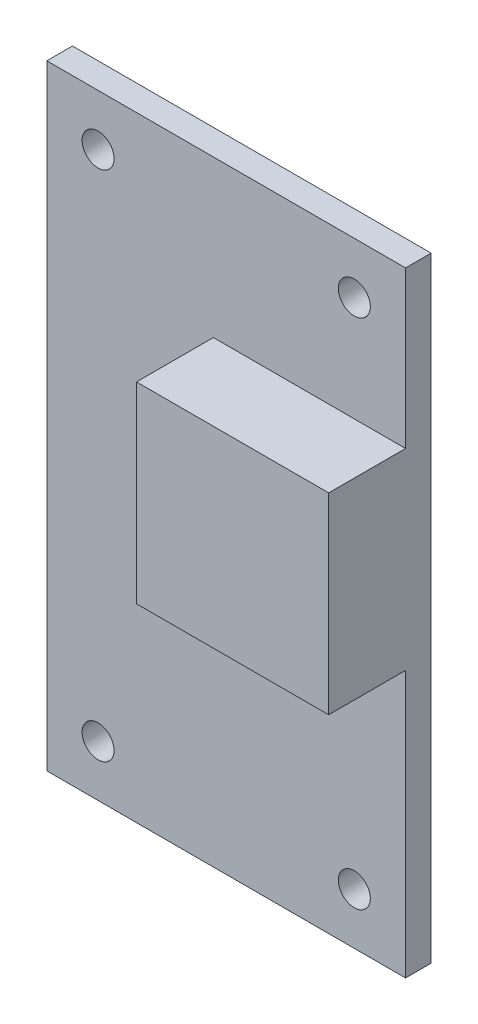
ISO-10303-21;
HEADER;
FILE_DESCRIPTION(('STEP AP214'),'2;1');
FILE_NAME('part.step','',(''),(''),'','','');
FILE_SCHEMA(('AUTOMOTIVE_DESIGN { 1 0 10303 214 1 1 1 1 }'));
ENDSEC;
DATA;
#1=APPLICATION_CONTEXT('core data for automotive mechanical design processes');
#2=APPLICATION_PROTOCOL_DEFINITION('international standard','automotive_design',2000,#1);
#3=PRODUCT_CONTEXT('',#1,'mechanical');
#4=PRODUCT('Part','Part','',(#3));
#5=PRODUCT_RELATED_PRODUCT_CATEGORY('part','',(#4));
#6=PRODUCT_DEFINITION_FORMATION('','',#4);
#7=PRODUCT_DEFINITION_CONTEXT('part definition',#1,'design');
#8=PRODUCT_DEFINITION('design','',#6,#7);
#9=PRODUCT_DEFINITION_SHAPE('','',#8);
#10=(LENGTH_UNIT() NAMED_UNIT(*) SI_UNIT(.MILLI.,.METRE.));
#11=(NAMED_UNIT(*) PLANE_ANGLE_UNIT() SI_UNIT($,.RADIAN.));
#12=(NAMED_UNIT(*) SI_UNIT($,.STERADIAN.) SOLID_ANGLE_UNIT());
#13=UNCERTAINTY_MEASURE_WITH_UNIT(LENGTH_MEASURE(1.E-05),#10,'distance_accuracy_value','');
#14=(GEOMETRIC_REPRESENTATION_CONTEXT(3) GLOBAL_UNCERTAINTY_ASSIGNED_CONTEXT((#13)) GLOBAL_UNIT_ASSIGNED_CONTEXT((#10,
#11,#12)) REPRESENTATION_CONTEXT('',''));
#15=CARTESIAN_POINT('',(0.,0.,0.));
#16=DIRECTION('',(0.,0.,1.));
#17=DIRECTION('',(1.,0.,0.));
#18=AXIS2_PLACEMENT_3D('',#15,#16,#17);
#19=CARTESIAN_POINT('',(0.,0.,2.));
#20=DIRECTION('',(0.,0.,-1.));
#21=DIRECTION('',(-1.,0.,0.));
#22=AXIS2_PLACEMENT_3D('',#19,#20,#21);
#23=PLANE('',#22);
#24=CARTESIAN_POINT('',(-10.,20.,2.));
#25=DIRECTION('',(0.,0.,1.));
#26=DIRECTION('',(1.,0.,0.));
#27=AXIS2_PLACEMENT_3D('',#24,#25,#26);
#28=CIRCLE('',#27,1.25);
#29=CARTESIAN_POINT('',(-8.75,20.,2.));
#30=VERTEX_POINT('',#29);
#31=EDGE_CURVE('E134',#30,#30,#28,.T.);
#32=ORIENTED_EDGE('',*,*,#31,.F.);
#33=EDGE_LOOP('',(#32));
#34=FACE_BOUND('',#33,.T.);
#35=CARTESIAN_POINT('',(10.,20.,2.));
#36=DIRECTION('',(0.,0.,1.));
#37=DIRECTION('',(1.,0.,0.));
#38=AXIS2_PLACEMENT_3D('',#35,#36,#37);
#39=CIRCLE('',#38,1.25);
#40=CARTESIAN_POINT('',(11.25,20.,2.));
#41=VERTEX_POINT('',#40);
#42=EDGE_CURVE('E135',#41,#41,#39,.T.);
#43=ORIENTED_EDGE('',*,*,#42,.F.);
#44=EDGE_LOOP('',(#43));
#45=FACE_BOUND('',#44,.T.);
#46=CARTESIAN_POINT('',(10.,-20.,2.));
#47=DIRECTION('',(0.,0.,1.));
#48=DIRECTION('',(1.,0.,0.));
#49=AXIS2_PLACEMENT_3D('',#46,#47,#48);
#50=CIRCLE('',#49,1.25);
#51=CARTESIAN_POINT('',(11.25,-20.,2.));
#52=VERTEX_POINT('',#51);
#53=EDGE_CURVE('E141',#52,#52,#50,.T.);
#54=ORIENTED_EDGE('',*,*,#53,.F.);
#55=EDGE_LOOP('',(#54));
#56=FACE_BOUND('',#55,.T.);
#57=CARTESIAN_POINT('',(-10.,-20.,2.));
#58=DIRECTION('',(0.,0.,1.));
#59=DIRECTION('',(1.,0.,0.));
#60=AXIS2_PLACEMENT_3D('',#57,#58,#59);
#61=CIRCLE('',#60,1.25);
#62=CARTESIAN_POINT('',(-8.75,-20.,2.));
#63=VERTEX_POINT('',#62);
#64=EDGE_CURVE('E122',#63,#63,#61,.T.);
#65=ORIENTED_EDGE('',*,*,#64,.F.);
#66=EDGE_LOOP('',(#65));
#67=FACE_BOUND('',#66,.T.);
#68=DIRECTION('',(1.,0.,0.));
#69=VECTOR('',#68,1.);
#70=CARTESIAN_POINT('',(14.,-3.20687743196867,2.));
#71=LINE('',#70,#69);
#72=CARTESIAN_POINT('',(-0.999999999999999,-3.20687743196867,2.));
#73=VERTEX_POINT('',#72);
#74=CARTESIAN_POINT('',(14.,-3.20687743196867,2.));
#75=VERTEX_POINT('',#74);
#76=EDGE_CURVE('E50',#73,#75,#71,.T.);
#77=ORIENTED_EDGE('',*,*,#76,.F.);
#78=DIRECTION('',(0.,-1.,0.));
#79=VECTOR('',#78,1.);
#80=CARTESIAN_POINT('',(-0.999999999999999,11.7931225680313,2.));
#81=LINE('',#80,#79);
#82=CARTESIAN_POINT('',(-0.999999999999999,11.7931225680313,2.));
#83=VERTEX_POINT('',#82);
#84=EDGE_CURVE('E195',#83,#73,#81,.T.);
#85=ORIENTED_EDGE('',*,*,#84,.F.);
#86=DIRECTION('',(-1.,0.,0.));
#87=VECTOR('',#86,1.);
#88=CARTESIAN_POINT('',(14.,11.7931225680313,2.));
#89=LINE('',#88,#87);
#90=CARTESIAN_POINT('',(14.,11.7931225680313,2.));
#91=VERTEX_POINT('',#90);
#92=EDGE_CURVE('E56',#91,#83,#89,.T.);
#93=ORIENTED_EDGE('',*,*,#92,.F.);
#94=DIRECTION('',(0.,1.,0.));
#95=VECTOR('',#94,1.);
#96=CARTESIAN_POINT('',(14.,-24.,2.));
#97=LINE('',#96,#95);
#98=CARTESIAN_POINT('',(14.,24.,2.));
#99=VERTEX_POINT('',#98);
#100=EDGE_CURVE('E121',#91,#99,#97,.T.);
#101=ORIENTED_EDGE('',*,*,#100,.T.);
#102=DIRECTION('',(-1.,0.,0.));
#103=VECTOR('',#102,1.);
#104=CARTESIAN_POINT('',(-14.,24.,2.));
#105=LINE('',#104,#103);
#106=CARTESIAN_POINT('',(-14.,24.,2.));
#107=VERTEX_POINT('',#106);
#108=EDGE_CURVE('E154',#99,#107,#105,.T.);
#109=ORIENTED_EDGE('',*,*,#108,.T.);
#110=DIRECTION('',(0.,-1.,0.));
#111=VECTOR('',#110,1.);
#112=CARTESIAN_POINT('',(-14.,-24.,2.));
#113=LINE('',#112,#111);
#114=CARTESIAN_POINT('',(-14.,-24.,2.));
#115=VERTEX_POINT('',#114);
#116=EDGE_CURVE('E156',#107,#115,#113,.T.);
#117=ORIENTED_EDGE('',*,*,#116,.T.);
#118=DIRECTION('',(1.,0.,0.));
#119=VECTOR('',#118,1.);
#120=CARTESIAN_POINT('',(-14.,-24.,2.));
#121=LINE('',#120,#119);
#122=CARTESIAN_POINT('',(14.,-24.,2.));
#123=VERTEX_POINT('',#122);
#124=EDGE_CURVE('E158',#115,#123,#121,.T.);
#125=ORIENTED_EDGE('',*,*,#124,.T.);
#126=EDGE_CURVE('E152',#123,#75,#97,.T.);
#127=ORIENTED_EDGE('',*,*,#126,.T.);
#128=EDGE_LOOP('',(#77,#85,#93,#101,#109,#117,#125,#127));
#129=FACE_BOUND('',#128,.T.);
#130=ADVANCED_FACE('F35',(#34,#45,#56,#67,#129),#23,.F.);
#131=CARTESIAN_POINT('',(14.,-24.,2.));
#132=DIRECTION('',(-1.,0.,0.));
#133=DIRECTION('',(0.,0.,1.));
#134=AXIS2_PLACEMENT_3D('',#131,#132,#133);
#135=PLANE('',#134);
#136=DIRECTION('',(0.,1.,0.));
#137=VECTOR('',#136,1.);
#138=CARTESIAN_POINT('',(14.,-24.,0.));
#139=LINE('',#138,#137);
#140=CARTESIAN_POINT('',(14.,-24.,0.));
#141=VERTEX_POINT('',#140);
#142=CARTESIAN_POINT('',(14.,24.,0.));
#143=VERTEX_POINT('',#142);
#144=EDGE_CURVE('E149',#141,#143,#139,.T.);
#145=ORIENTED_EDGE('',*,*,#144,.T.);
#146=DIRECTION('',(0.,0.,-1.));
#147=VECTOR('',#146,1.);
#148=CARTESIAN_POINT('',(14.,24.,2.));
#149=LINE('',#148,#147);
#150=EDGE_CURVE('E11',#99,#143,#149,.T.);
#151=ORIENTED_EDGE('',*,*,#150,.F.);
#152=ORIENTED_EDGE('',*,*,#100,.F.);
#153=DIRECTION('',(0.,0.,-1.));
#154=VECTOR('',#153,1.);
#155=CARTESIAN_POINT('',(14.,11.7931225680313,8.));
#156=LINE('',#155,#154);
#157=CARTESIAN_POINT('',(14.,11.7931225680313,8.));
#158=VERTEX_POINT('',#157);
#159=EDGE_CURVE('E103',#158,#91,#156,.T.);
#160=ORIENTED_EDGE('',*,*,#159,.F.);
#161=DIRECTION('',(0.,1.,0.));
#162=VECTOR('',#161,1.);
#163=CARTESIAN_POINT('',(14.,11.7931225680313,8.));
#164=LINE('',#163,#162);
#165=CARTESIAN_POINT('',(14.,-3.20687743196867,8.));
#166=VERTEX_POINT('',#165);
#167=EDGE_CURVE('E109',#166,#158,#164,.T.);
#168=ORIENTED_EDGE('',*,*,#167,.F.);
#169=DIRECTION('',(0.,0.,-1.));
#170=VECTOR('',#169,1.);
#171=CARTESIAN_POINT('',(14.,-3.20687743196867,8.));
#172=LINE('',#171,#170);
#173=EDGE_CURVE('E190',#166,#75,#172,.T.);
#174=ORIENTED_EDGE('',*,*,#173,.T.);
#175=ORIENTED_EDGE('',*,*,#126,.F.);
#176=DIRECTION('',(0.,0.,-1.));
#177=VECTOR('',#176,1.);
#178=CARTESIAN_POINT('',(14.,-24.,2.));
#179=LINE('',#178,#177);
#180=EDGE_CURVE('E160',#123,#141,#179,.T.);
#181=ORIENTED_EDGE('',*,*,#180,.T.);
#182=EDGE_LOOP('',(#145,#151,#152,#160,#168,#174,#175,#181));
#183=FACE_BOUND('',#182,.T.);
#184=ADVANCED_FACE('F37',(#183),#135,.F.);
#185=CARTESIAN_POINT('',(-14.,24.,2.));
#186=DIRECTION('',(0.,-1.,0.));
#187=DIRECTION('',(0.,0.,-1.));
#188=AXIS2_PLACEMENT_3D('',#185,#186,#187);
#189=PLANE('',#188);
#190=DIRECTION('',(-1.,0.,0.));
#191=VECTOR('',#190,1.);
#192=CARTESIAN_POINT('',(-14.,24.,0.));
#193=LINE('',#192,#191);
#194=CARTESIAN_POINT('',(-14.,24.,0.));
#195=VERTEX_POINT('',#194);
#196=EDGE_CURVE('E162',#143,#195,#193,.T.);
#197=ORIENTED_EDGE('',*,*,#196,.T.);
#198=DIRECTION('',(0.,0.,-1.));
#199=VECTOR('',#198,1.);
#200=CARTESIAN_POINT('',(-14.,24.,2.));
#201=LINE('',#200,#199);
#202=EDGE_CURVE('E43',#107,#195,#201,.T.);
#203=ORIENTED_EDGE('',*,*,#202,.F.);
#204=ORIENTED_EDGE('',*,*,#108,.F.);
#205=ORIENTED_EDGE('',*,*,#150,.T.);
#206=EDGE_LOOP('',(#197,#203,#204,#205));
#207=FACE_BOUND('',#206,.T.);
#208=ADVANCED_FACE('F221',(#207),#189,.F.);
#209=CARTESIAN_POINT('',(-14.,-24.,2.));
#210=DIRECTION('',(1.,0.,0.));
#211=DIRECTION('',(0.,0.,-1.));
#212=AXIS2_PLACEMENT_3D('',#209,#210,#211);
#213=PLANE('',#212);
#214=DIRECTION('',(0.,-1.,0.));
#215=VECTOR('',#214,1.);
#216=CARTESIAN_POINT('',(-14.,-24.,0.));
#217=LINE('',#216,#215);
#218=CARTESIAN_POINT('',(-14.,-24.,0.));
#219=VERTEX_POINT('',#218);
#220=EDGE_CURVE('E164',#195,#219,#217,.T.);
#221=ORIENTED_EDGE('',*,*,#220,.T.);
#222=DIRECTION('',(0.,0.,-1.));
#223=VECTOR('',#222,1.);
#224=CARTESIAN_POINT('',(-14.,-24.,2.));
#225=LINE('',#224,#223);
#226=EDGE_CURVE('E170',#115,#219,#225,.T.);
#227=ORIENTED_EDGE('',*,*,#226,.F.);
#228=ORIENTED_EDGE('',*,*,#116,.F.);
#229=ORIENTED_EDGE('',*,*,#202,.T.);
#230=EDGE_LOOP('',(#221,#227,#228,#229));
#231=FACE_BOUND('',#230,.T.);
#232=ADVANCED_FACE('F177',(#231),#213,.F.);
#233=CARTESIAN_POINT('',(-14.,-24.,2.));
#234=DIRECTION('',(0.,1.,0.));
#235=DIRECTION('',(0.,0.,1.));
#236=AXIS2_PLACEMENT_3D('',#233,#234,#235);
#237=PLANE('',#236);
#238=DIRECTION('',(1.,0.,0.));
#239=VECTOR('',#238,1.);
#240=CARTESIAN_POINT('',(-14.,-24.,0.));
#241=LINE('',#240,#239);
#242=EDGE_CURVE('E166',#219,#141,#241,.T.);
#243=ORIENTED_EDGE('',*,*,#242,.T.);
#244=ORIENTED_EDGE('',*,*,#180,.F.);
#245=ORIENTED_EDGE('',*,*,#124,.F.);
#246=ORIENTED_EDGE('',*,*,#226,.T.);
#247=EDGE_LOOP('',(#243,#244,#245,#246));
#248=FACE_BOUND('',#247,.T.);
#249=ADVANCED_FACE('F187',(#248),#237,.F.);
#250=CARTESIAN_POINT('',(0.,0.,0.));
#251=DIRECTION('',(0.,0.,-1.));
#252=DIRECTION('',(-1.,0.,0.));
#253=AXIS2_PLACEMENT_3D('',#250,#251,#252);
#254=PLANE('',#253);
#255=CARTESIAN_POINT('',(-10.,-20.,0.));
#256=DIRECTION('',(0.,0.,1.));
#257=DIRECTION('',(1.,0.,0.));
#258=AXIS2_PLACEMENT_3D('',#255,#256,#257);
#259=CIRCLE('',#258,1.25);
#260=CARTESIAN_POINT('',(-8.75,-20.,0.));
#261=VERTEX_POINT('',#260);
#262=EDGE_CURVE('E125',#261,#261,#259,.T.);
#263=ORIENTED_EDGE('',*,*,#262,.T.);
#264=EDGE_LOOP('',(#263));
#265=FACE_BOUND('',#264,.T.);
#266=CARTESIAN_POINT('',(10.,-20.,0.));
#267=DIRECTION('',(0.,0.,1.));
#268=DIRECTION('',(1.,0.,0.));
#269=AXIS2_PLACEMENT_3D('',#266,#267,#268);
#270=CIRCLE('',#269,1.25);
#271=CARTESIAN_POINT('',(11.25,-20.,0.));
#272=VERTEX_POINT('',#271);
#273=EDGE_CURVE('E138',#272,#272,#270,.T.);
#274=ORIENTED_EDGE('',*,*,#273,.T.);
#275=EDGE_LOOP('',(#274));
#276=FACE_BOUND('',#275,.T.);
#277=CARTESIAN_POINT('',(10.,20.,0.));
#278=DIRECTION('',(0.,0.,1.));
#279=DIRECTION('',(1.,0.,0.));
#280=AXIS2_PLACEMENT_3D('',#277,#278,#279);
#281=CIRCLE('',#280,1.25);
#282=CARTESIAN_POINT('',(11.25,20.,0.));
#283=VERTEX_POINT('',#282);
#284=EDGE_CURVE('E131',#283,#283,#281,.T.);
#285=ORIENTED_EDGE('',*,*,#284,.T.);
#286=EDGE_LOOP('',(#285));
#287=FACE_BOUND('',#286,.T.);
#288=CARTESIAN_POINT('',(-10.,20.,0.));
#289=DIRECTION('',(0.,0.,1.));
#290=DIRECTION('',(1.,0.,0.));
#291=AXIS2_PLACEMENT_3D('',#288,#289,#290);
#292=CIRCLE('',#291,1.25);
#293=CARTESIAN_POINT('',(-8.75,20.,0.));
#294=VERTEX_POINT('',#293);
#295=EDGE_CURVE('E146',#294,#294,#292,.T.);
#296=ORIENTED_EDGE('',*,*,#295,.T.);
#297=EDGE_LOOP('',(#296));
#298=FACE_BOUND('',#297,.T.);
#299=ORIENTED_EDGE('',*,*,#144,.F.);
#300=ORIENTED_EDGE('',*,*,#242,.F.);
#301=ORIENTED_EDGE('',*,*,#220,.F.);
#302=ORIENTED_EDGE('',*,*,#196,.F.);
#303=EDGE_LOOP('',(#299,#300,#301,#302));
#304=FACE_BOUND('',#303,.T.);
#305=ADVANCED_FACE('F184',(#265,#276,#287,#298,#304),#254,.T.);
#306=CARTESIAN_POINT('',(-10.,20.,0.));
#307=DIRECTION('',(0.,0.,1.));
#308=DIRECTION('',(1.,0.,0.));
#309=AXIS2_PLACEMENT_3D('',#306,#307,#308);
#310=CYLINDRICAL_SURFACE('',#309,1.25);
#311=ORIENTED_EDGE('',*,*,#295,.F.);
#312=EDGE_LOOP('',(#311));
#313=FACE_BOUND('',#312,.T.);
#314=ORIENTED_EDGE('',*,*,#31,.T.);
#315=EDGE_LOOP('',(#314));
#316=FACE_BOUND('',#315,.T.);
#317=ADVANCED_FACE('F226',(#313,#316),#310,.F.);
#318=CARTESIAN_POINT('',(10.,20.,0.));
#319=DIRECTION('',(0.,0.,1.));
#320=DIRECTION('',(1.,0.,0.));
#321=AXIS2_PLACEMENT_3D('',#318,#319,#320);
#322=CYLINDRICAL_SURFACE('',#321,1.25);
#323=ORIENTED_EDGE('',*,*,#284,.F.);
#324=EDGE_LOOP('',(#323));
#325=FACE_BOUND('',#324,.T.);
#326=ORIENTED_EDGE('',*,*,#42,.T.);
#327=EDGE_LOOP('',(#326));
#328=FACE_BOUND('',#327,.T.);
#329=ADVANCED_FACE('F255',(#325,#328),#322,.F.);
#330=CARTESIAN_POINT('',(10.,-20.,0.));
#331=DIRECTION('',(0.,0.,1.));
#332=DIRECTION('',(1.,0.,0.));
#333=AXIS2_PLACEMENT_3D('',#330,#331,#332);
#334=CYLINDRICAL_SURFACE('',#333,1.25);
#335=ORIENTED_EDGE('',*,*,#273,.F.);
#336=EDGE_LOOP('',(#335));
#337=FACE_BOUND('',#336,.T.);
#338=ORIENTED_EDGE('',*,*,#53,.T.);
#339=EDGE_LOOP('',(#338));
#340=FACE_BOUND('',#339,.T.);
#341=ADVANCED_FACE('F262',(#337,#340),#334,.F.);
#342=CARTESIAN_POINT('',(-10.,-20.,0.));
#343=DIRECTION('',(0.,0.,1.));
#344=DIRECTION('',(1.,0.,0.));
#345=AXIS2_PLACEMENT_3D('',#342,#343,#344);
#346=CYLINDRICAL_SURFACE('',#345,1.25);
#347=ORIENTED_EDGE('',*,*,#262,.F.);
#348=EDGE_LOOP('',(#347));
#349=FACE_BOUND('',#348,.T.);
#350=ORIENTED_EDGE('',*,*,#64,.T.);
#351=EDGE_LOOP('',(#350));
#352=FACE_BOUND('',#351,.T.);
#353=ADVANCED_FACE('F211',(#349,#352),#346,.F.);
#354=CARTESIAN_POINT('',(14.,11.7931225680313,8.));
#355=DIRECTION('',(0.,-1.,0.));
#356=DIRECTION('',(0.,0.,-1.));
#357=AXIS2_PLACEMENT_3D('',#354,#355,#356);
#358=PLANE('',#357);
#359=ORIENTED_EDGE('',*,*,#92,.T.);
#360=DIRECTION('',(0.,0.,-1.));
#361=VECTOR('',#360,1.);
#362=CARTESIAN_POINT('',(-0.999999999999999,11.7931225680313,8.));
#363=LINE('',#362,#361);
#364=CARTESIAN_POINT('',(-0.999999999999999,11.7931225680313,8.));
#365=VERTEX_POINT('',#364);
#366=EDGE_CURVE('E105',#365,#83,#363,.T.);
#367=ORIENTED_EDGE('',*,*,#366,.F.);
#368=DIRECTION('',(-1.,0.,0.));
#369=VECTOR('',#368,1.);
#370=CARTESIAN_POINT('',(14.,11.7931225680313,8.));
#371=LINE('',#370,#369);
#372=EDGE_CURVE('E99',#158,#365,#371,.T.);
#373=ORIENTED_EDGE('',*,*,#372,.F.);
#374=ORIENTED_EDGE('',*,*,#159,.T.);
#375=EDGE_LOOP('',(#359,#367,#373,#374));
#376=FACE_BOUND('',#375,.T.);
#377=ADVANCED_FACE('F101',(#376),#358,.F.);
#378=CARTESIAN_POINT('',(-0.999999999999999,11.7931225680313,8.));
#379=DIRECTION('',(1.,0.,0.));
#380=DIRECTION('',(0.,0.,-1.));
#381=AXIS2_PLACEMENT_3D('',#378,#379,#380);
#382=PLANE('',#381);
#383=ORIENTED_EDGE('',*,*,#84,.T.);
#384=DIRECTION('',(0.,0.,-1.));
#385=VECTOR('',#384,1.);
#386=CARTESIAN_POINT('',(-0.999999999999999,-3.20687743196867,8.));
#387=LINE('',#386,#385);
#388=CARTESIAN_POINT('',(-0.999999999999999,-3.20687743196867,8.));
#389=VERTEX_POINT('',#388);
#390=EDGE_CURVE('E127',#389,#73,#387,.T.);
#391=ORIENTED_EDGE('',*,*,#390,.F.);
#392=DIRECTION('',(0.,-1.,0.));
#393=VECTOR('',#392,1.);
#394=CARTESIAN_POINT('',(-0.999999999999999,11.7931225680313,8.));
#395=LINE('',#394,#393);
#396=EDGE_CURVE('E108',#365,#389,#395,.T.);
#397=ORIENTED_EDGE('',*,*,#396,.F.);
#398=ORIENTED_EDGE('',*,*,#366,.T.);
#399=EDGE_LOOP('',(#383,#391,#397,#398));
#400=FACE_BOUND('',#399,.T.);
#401=ADVANCED_FACE('F203',(#400),#382,.F.);
#402=CARTESIAN_POINT('',(14.,-3.20687743196867,8.));
#403=DIRECTION('',(0.,1.,0.));
#404=DIRECTION('',(0.,0.,1.));
#405=AXIS2_PLACEMENT_3D('',#402,#403,#404);
#406=PLANE('',#405);
#407=ORIENTED_EDGE('',*,*,#76,.T.);
#408=ORIENTED_EDGE('',*,*,#173,.F.);
#409=DIRECTION('',(1.,0.,0.));
#410=VECTOR('',#409,1.);
#411=CARTESIAN_POINT('',(14.,-3.20687743196867,8.));
#412=LINE('',#411,#410);
#413=EDGE_CURVE('E114',#389,#166,#412,.T.);
#414=ORIENTED_EDGE('',*,*,#413,.F.);
#415=ORIENTED_EDGE('',*,*,#390,.T.);
#416=EDGE_LOOP('',(#407,#408,#414,#415));
#417=FACE_BOUND('',#416,.T.);
#418=ADVANCED_FACE('F193',(#417),#406,.F.);
#419=CARTESIAN_POINT('',(0.,0.,8.));
#420=DIRECTION('',(0.,0.,-1.));
#421=DIRECTION('',(-1.,0.,0.));
#422=AXIS2_PLACEMENT_3D('',#419,#420,#421);
#423=PLANE('',#422);
#424=ORIENTED_EDGE('',*,*,#167,.T.);
#425=ORIENTED_EDGE('',*,*,#372,.T.);
#426=ORIENTED_EDGE('',*,*,#396,.T.);
#427=ORIENTED_EDGE('',*,*,#413,.T.);
#428=EDGE_LOOP('',(#424,#425,#426,#427));
#429=FACE_BOUND('',#428,.T.);
#430=ADVANCED_FACE('F112',(#429),#423,.F.);
#431=CLOSED_SHELL('',(#130,#184,#208,#232,#249,#305,#317,#329,#341,#353,#377,#401,#418,#430));
#432=MANIFOLD_SOLID_BREP('B2',#431);
#433=ADVANCED_BREP_SHAPE_REPRESENTATION('',(#18,#432),#14);
#434=SHAPE_DEFINITION_REPRESENTATION(#9,#433);
ENDSEC;
END-ISO-10303-21;
